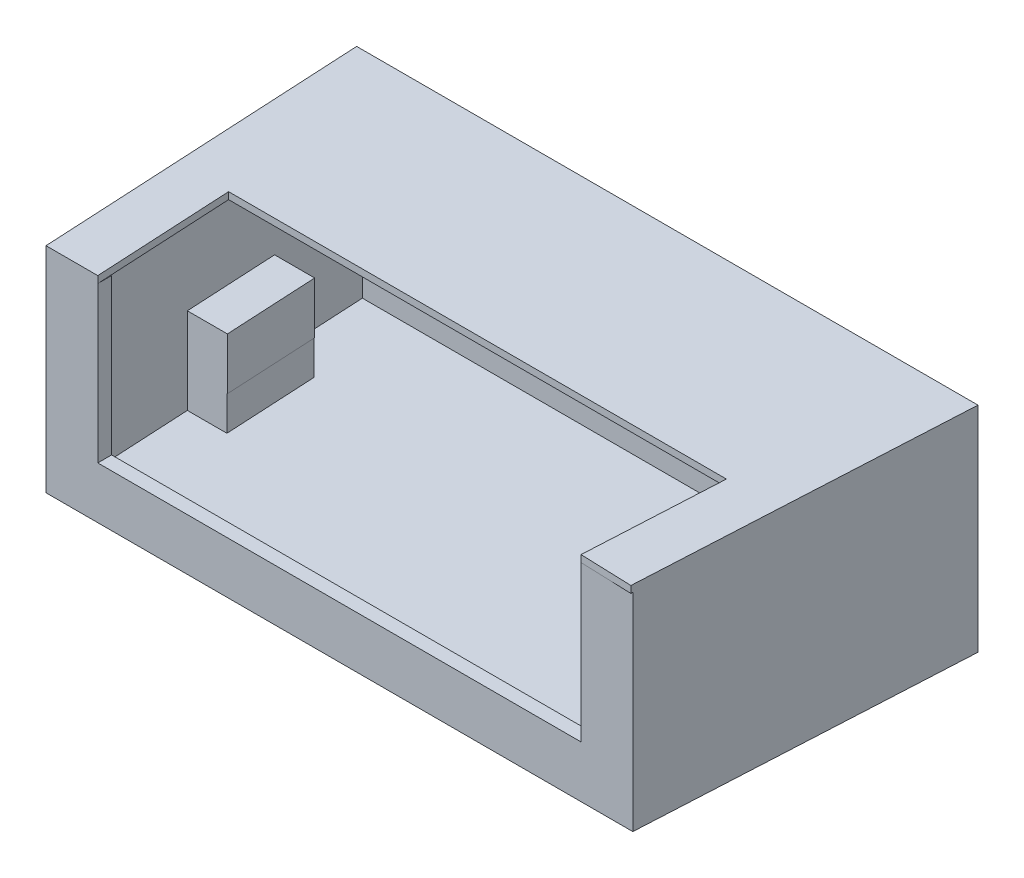
ISO-10303-21;
HEADER;
FILE_DESCRIPTION(('STEP AP214'),'2;1');
FILE_NAME('part.step','',(''),(''),'','','');
FILE_SCHEMA(('AUTOMOTIVE_DESIGN { 1 0 10303 214 1 1 1 1 }'));
ENDSEC;
DATA;
#1=APPLICATION_CONTEXT('core data for automotive mechanical design processes');
#2=APPLICATION_PROTOCOL_DEFINITION('international standard','automotive_design',2000,#1);
#3=PRODUCT_CONTEXT('',#1,'mechanical');
#4=PRODUCT('Part','Part','',(#3));
#5=PRODUCT_RELATED_PRODUCT_CATEGORY('part','',(#4));
#6=PRODUCT_DEFINITION_FORMATION('','',#4);
#7=PRODUCT_DEFINITION_CONTEXT('part definition',#1,'design');
#8=PRODUCT_DEFINITION('design','',#6,#7);
#9=PRODUCT_DEFINITION_SHAPE('','',#8);
#10=(LENGTH_UNIT() NAMED_UNIT(*) SI_UNIT(.MILLI.,.METRE.));
#11=(NAMED_UNIT(*) PLANE_ANGLE_UNIT() SI_UNIT($,.RADIAN.));
#12=(NAMED_UNIT(*) SI_UNIT($,.STERADIAN.) SOLID_ANGLE_UNIT());
#13=UNCERTAINTY_MEASURE_WITH_UNIT(LENGTH_MEASURE(1.E-05),#10,'distance_accuracy_value','');
#14=(GEOMETRIC_REPRESENTATION_CONTEXT(3) GLOBAL_UNCERTAINTY_ASSIGNED_CONTEXT((#13)) GLOBAL_UNIT_ASSIGNED_CONTEXT((#10,
#11,#12)) REPRESENTATION_CONTEXT('',''));
#15=CARTESIAN_POINT('',(0.,0.,0.));
#16=DIRECTION('',(0.,0.,1.));
#17=DIRECTION('',(1.,0.,0.));
#18=AXIS2_PLACEMENT_3D('',#15,#16,#17);
#19=CARTESIAN_POINT('',(0.,600.,0.));
#20=DIRECTION('',(0.,1.,0.));
#21=DIRECTION('',(0.,0.,1.));
#22=AXIS2_PLACEMENT_3D('',#19,#20,#21);
#23=PLANE('',#22);
#24=DIRECTION('',(-0.0525588331227629,0.,0.99861782933251));
#25=VECTOR('',#24,1.);
#26=CARTESIAN_POINT('',(721.056000817267,600.,-400.064015528074));
#27=LINE('',#26,#25);
#28=CARTESIAN_POINT('',(702.105263157895,600.,-40.0000000000002));
#29=VERTEX_POINT('',#28);
#30=CARTESIAN_POINT('',(700.,600.,0.));
#31=VERTEX_POINT('',#30);
#32=EDGE_CURVE('E11',#29,#31,#27,.T.);
#33=ORIENTED_EDGE('',*,*,#32,.F.);
#34=DIRECTION('',(1.,0.,0.));
#35=VECTOR('',#34,1.);
#36=CARTESIAN_POINT('',(785.,600.,-40.0000000000002));
#37=LINE('',#36,#35);
#38=CARTESIAN_POINT('',(700.,600.,-40.));
#39=VERTEX_POINT('',#38);
#40=EDGE_CURVE('E418',#39,#29,#37,.T.);
#41=ORIENTED_EDGE('',*,*,#40,.F.);
#42=DIRECTION('',(0.,0.,1.));
#43=VECTOR('',#42,1.);
#44=CARTESIAN_POINT('',(700.,600.,0.));
#45=LINE('',#44,#43);
#46=EDGE_CURVE('E399',#39,#31,#45,.T.);
#47=ORIENTED_EDGE('',*,*,#46,.T.);
#48=EDGE_LOOP('',(#33,#41,#47));
#49=FACE_BOUND('',#48,.T.);
#50=ADVANCED_FACE('F39',(#49),#23,.T.);
#51=CARTESIAN_POINT('',(0.,150.,0.));
#52=DIRECTION('',(0.,-1.,0.));
#53=DIRECTION('',(0.,0.,-1.));
#54=AXIS2_PLACEMENT_3D('',#51,#52,#53);
#55=PLANE('',#54);
#56=DIRECTION('',(0.0525588331227641,0.,-0.99861782933251));
#57=VECTOR('',#56,1.);
#58=CARTESIAN_POINT('',(709.135748768587,150.,-628.151045218347));
#59=LINE('',#58,#57);
#60=CARTESIAN_POINT('',(695.096165278991,150.,-361.398958916023));
#61=VERTEX_POINT('',#60);
#62=CARTESIAN_POINT('',(709.135748768587,150.,-628.151045218346));
#63=VERTEX_POINT('',#62);
#64=EDGE_CURVE('E365',#61,#63,#59,.T.);
#65=ORIENTED_EDGE('',*,*,#64,.T.);
#66=DIRECTION('',(1.,0.,0.));
#67=VECTOR('',#66,1.);
#68=CARTESIAN_POINT('',(708.81483793089,150.,-628.151045218346));
#69=LINE('',#68,#67);
#70=CARTESIAN_POINT('',(708.81483793089,150.,-628.151045218346));
#71=VERTEX_POINT('',#70);
#72=EDGE_CURVE('E301',#71,#63,#69,.T.);
#73=ORIENTED_EDGE('',*,*,#72,.F.);
#74=DIRECTION('',(0.0532842530242441,0.,-0.998579385116501));
#75=VECTOR('',#74,1.);
#76=CARTESIAN_POINT('',(694.580931370102,150.,-361.398958916023));
#77=LINE('',#76,#75);
#78=CARTESIAN_POINT('',(694.580931370102,150.,-361.398958916023));
#79=VERTEX_POINT('',#78);
#80=EDGE_CURVE('E337',#79,#71,#77,.T.);
#81=ORIENTED_EDGE('',*,*,#80,.F.);
#82=DIRECTION('',(1.,0.,0.));
#83=VECTOR('',#82,1.);
#84=CARTESIAN_POINT('',(0.,150.,-361.398958916023));
#85=LINE('',#84,#83);
#86=EDGE_CURVE('E43',#79,#61,#85,.T.);
#87=ORIENTED_EDGE('',*,*,#86,.T.);
#88=EDGE_LOOP('',(#65,#73,#81,#87));
#89=FACE_BOUND('',#88,.T.);
#90=ADVANCED_FACE('F462',(#89),#55,.F.);
#91=CARTESIAN_POINT('',(850.,600.,0.));
#92=DIRECTION('',(0.,0.,-1.));
#93=DIRECTION('',(-1.,0.,0.));
#94=AXIS2_PLACEMENT_3D('',#91,#92,#93);
#95=PLANE('',#94);
#96=DIRECTION('',(0.,-1.,0.));
#97=VECTOR('',#96,1.);
#98=CARTESIAN_POINT('',(-700.,610.,0.));
#99=LINE('',#98,#97);
#100=CARTESIAN_POINT('',(-700.,600.,0.));
#101=VERTEX_POINT('',#100);
#102=CARTESIAN_POINT('',(-700.,150.,0.));
#103=VERTEX_POINT('',#102);
#104=EDGE_CURVE('E384',#101,#103,#99,.T.);
#105=ORIENTED_EDGE('',*,*,#104,.F.);
#106=DIRECTION('',(0.,-1.,0.));
#107=VECTOR('',#106,1.);
#108=CARTESIAN_POINT('',(-700.,620.,0.));
#109=LINE('',#108,#107);
#110=CARTESIAN_POINT('',(-700.,620.,0.));
#111=VERTEX_POINT('',#110);
#112=EDGE_CURVE('E293',#111,#101,#109,.T.);
#113=ORIENTED_EDGE('',*,*,#112,.F.);
#114=DIRECTION('',(1.,0.,0.));
#115=VECTOR('',#114,1.);
#116=CARTESIAN_POINT('',(-850.,620.,0.));
#117=LINE('',#116,#115);
#118=CARTESIAN_POINT('',(-850.,620.,0.));
#119=VERTEX_POINT('',#118);
#120=EDGE_CURVE('E251',#119,#111,#117,.T.);
#121=ORIENTED_EDGE('',*,*,#120,.F.);
#122=DIRECTION('',(0.,-1.,0.));
#123=VECTOR('',#122,1.);
#124=CARTESIAN_POINT('',(-850.,600.,0.));
#125=LINE('',#124,#123);
#126=CARTESIAN_POINT('',(-850.,0.,0.));
#127=VERTEX_POINT('',#126);
#128=EDGE_CURVE('E243',#119,#127,#125,.T.);
#129=ORIENTED_EDGE('',*,*,#128,.T.);
#130=DIRECTION('',(1.,0.,0.));
#131=VECTOR('',#130,1.);
#132=CARTESIAN_POINT('',(850.,0.,0.));
#133=LINE('',#132,#131);
#134=CARTESIAN_POINT('',(850.,0.,0.));
#135=VERTEX_POINT('',#134);
#136=EDGE_CURVE('E424',#127,#135,#133,.T.);
#137=ORIENTED_EDGE('',*,*,#136,.T.);
#138=DIRECTION('',(0.,-1.,0.));
#139=VECTOR('',#138,1.);
#140=CARTESIAN_POINT('',(850.,600.,0.));
#141=LINE('',#140,#139);
#142=CARTESIAN_POINT('',(850.,600.,0.));
#143=VERTEX_POINT('',#142);
#144=EDGE_CURVE('E444',#143,#135,#141,.T.);
#145=ORIENTED_EDGE('',*,*,#144,.F.);
#146=DIRECTION('',(1.,0.,0.));
#147=VECTOR('',#146,1.);
#148=CARTESIAN_POINT('',(850.,600.,0.));
#149=LINE('',#148,#147);
#150=EDGE_CURVE('E432',#31,#143,#149,.T.);
#151=ORIENTED_EDGE('',*,*,#150,.F.);
#152=DIRECTION('',(0.,-1.,0.));
#153=VECTOR('',#152,1.);
#154=CARTESIAN_POINT('',(700.,610.,0.));
#155=LINE('',#154,#153);
#156=CARTESIAN_POINT('',(700.,150.,0.));
#157=VERTEX_POINT('',#156);
#158=EDGE_CURVE('E381',#31,#157,#155,.T.);
#159=ORIENTED_EDGE('',*,*,#158,.T.);
#160=DIRECTION('',(1.,0.,0.));
#161=VECTOR('',#160,1.);
#162=CARTESIAN_POINT('',(700.,150.,0.));
#163=LINE('',#162,#161);
#164=EDGE_CURVE('E359',#103,#157,#163,.T.);
#165=ORIENTED_EDGE('',*,*,#164,.F.);
#166=EDGE_LOOP('',(#105,#113,#121,#129,#137,#145,#151,#159,#165));
#167=FACE_BOUND('',#166,.T.);
#168=ADVANCED_FACE('F41',(#167),#95,.F.);
#169=DIRECTION('',(-0.052558833122764,0.,-0.99861782933251));
#170=VECTOR('',#169,1.);
#171=CARTESIAN_POINT('',(-700.,600.,0.));
#172=LINE('',#171,#170);
#173=CARTESIAN_POINT('',(-702.105263157895,600.,-40.));
#174=VERTEX_POINT('',#173);
#175=EDGE_CURVE('E274',#101,#174,#172,.T.);
#176=ORIENTED_EDGE('',*,*,#175,.F.);
#177=DIRECTION('',(0.,0.,-1.));
#178=VECTOR('',#177,1.);
#179=CARTESIAN_POINT('',(-700.,600.,0.));
#180=LINE('',#179,#178);
#181=CARTESIAN_POINT('',(-700.,600.,-40.));
#182=VERTEX_POINT('',#181);
#183=EDGE_CURVE('E401',#101,#182,#180,.T.);
#184=ORIENTED_EDGE('',*,*,#183,.T.);
#185=EDGE_CURVE('E417',#174,#182,#37,.T.);
#186=ORIENTED_EDGE('',*,*,#185,.F.);
#187=EDGE_LOOP('',(#176,#184,#186));
#188=FACE_BOUND('',#187,.T.);
#189=ADVANCED_FACE('F527',(#188),#23,.T.);
#190=CARTESIAN_POINT('',(785.,300.,-40.0000000000002));
#191=DIRECTION('',(0.,0.,1.));
#192=DIRECTION('',(1.,0.,0.));
#193=AXIS2_PLACEMENT_3D('',#190,#191,#192);
#194=PLANE('',#193);
#195=DIRECTION('',(0.,-1.,0.));
#196=VECTOR('',#195,1.);
#197=CARTESIAN_POINT('',(700.,610.,-40.));
#198=LINE('',#197,#196);
#199=CARTESIAN_POINT('',(700.,150.,-40.));
#200=VERTEX_POINT('',#199);
#201=EDGE_CURVE('E378',#39,#200,#198,.T.);
#202=ORIENTED_EDGE('',*,*,#201,.F.);
#203=ORIENTED_EDGE('',*,*,#40,.T.);
#204=CARTESIAN_POINT('',(785.,600.,-40.0000000000002));
#205=VERTEX_POINT('',#204);
#206=EDGE_CURVE('E413',#29,#205,#37,.T.);
#207=ORIENTED_EDGE('',*,*,#206,.T.);
#208=DIRECTION('',(0.,1.,0.));
#209=VECTOR('',#208,1.);
#210=CARTESIAN_POINT('',(785.,300.,-40.0000000000002));
#211=LINE('',#210,#209);
#212=CARTESIAN_POINT('',(785.,50.,-40.));
#213=VERTEX_POINT('',#212);
#214=EDGE_CURVE('E428',#213,#205,#211,.T.);
#215=ORIENTED_EDGE('',*,*,#214,.F.);
#216=DIRECTION('',(1.,0.,0.));
#217=VECTOR('',#216,1.);
#218=CARTESIAN_POINT('',(-785.,50.,-40.));
#219=LINE('',#218,#217);
#220=CARTESIAN_POINT('',(-785.,50.,-40.));
#221=VERTEX_POINT('',#220);
#222=EDGE_CURVE('E316',#221,#213,#219,.T.);
#223=ORIENTED_EDGE('',*,*,#222,.F.);
#224=DIRECTION('',(0.,1.,0.));
#225=VECTOR('',#224,1.);
#226=CARTESIAN_POINT('',(-785.,300.,-40.));
#227=LINE('',#226,#225);
#228=CARTESIAN_POINT('',(-785.,600.,-40.));
#229=VERTEX_POINT('',#228);
#230=EDGE_CURVE('E411',#221,#229,#227,.T.);
#231=ORIENTED_EDGE('',*,*,#230,.T.);
#232=EDGE_CURVE('E414',#229,#174,#37,.T.);
#233=ORIENTED_EDGE('',*,*,#232,.T.);
#234=ORIENTED_EDGE('',*,*,#185,.T.);
#235=DIRECTION('',(0.,-1.,0.));
#236=VECTOR('',#235,1.);
#237=CARTESIAN_POINT('',(-700.,610.,-40.));
#238=LINE('',#237,#236);
#239=CARTESIAN_POINT('',(-700.,150.,-40.));
#240=VERTEX_POINT('',#239);
#241=EDGE_CURVE('E386',#182,#240,#238,.T.);
#242=ORIENTED_EDGE('',*,*,#241,.T.);
#243=DIRECTION('',(-1.,0.,0.));
#244=VECTOR('',#243,1.);
#245=CARTESIAN_POINT('',(0.,150.,-40.));
#246=LINE('',#245,#244);
#247=EDGE_CURVE('E458',#200,#240,#246,.T.);
#248=ORIENTED_EDGE('',*,*,#247,.F.);
#249=EDGE_LOOP('',(#202,#203,#207,#215,#223,#231,#233,#234,#242,#248));
#250=FACE_BOUND('',#249,.T.);
#251=ADVANCED_FACE('F523',(#250),#194,.F.);
#252=CARTESIAN_POINT('',(0.,300.,0.));
#253=DIRECTION('',(0.,-1.,0.));
#254=DIRECTION('',(0.,0.,-1.));
#255=AXIS2_PLACEMENT_3D('',#252,#253,#254);
#256=PLANE('',#255);
#257=DIRECTION('',(1.,0.,0.));
#258=VECTOR('',#257,1.);
#259=CARTESIAN_POINT('',(0.,300.,-628.151045218346));
#260=LINE('',#259,#258);
#261=CARTESIAN_POINT('',(-815.955318169387,300.,-628.151045218346));
#262=VERTEX_POINT('',#261);
#263=CARTESIAN_POINT('',(-699.853867240202,300.,-628.151045218346));
#264=VERTEX_POINT('',#263);
#265=EDGE_CURVE('E457',#262,#264,#260,.T.);
#266=ORIENTED_EDGE('',*,*,#265,.F.);
#267=DIRECTION('',(0.0525588331227639,0.,0.99861782933251));
#268=VECTOR('',#267,1.);
#269=CARTESIAN_POINT('',(-785.,300.,-40.));
#270=LINE('',#269,#268);
#271=CARTESIAN_POINT('',(-801.915734679791,300.,-361.398958916023));
#272=VERTEX_POINT('',#271);
#273=EDGE_CURVE('E404',#262,#272,#270,.T.);
#274=ORIENTED_EDGE('',*,*,#273,.T.);
#275=DIRECTION('',(-1.,0.,0.));
#276=VECTOR('',#275,1.);
#277=CARTESIAN_POINT('',(0.,300.,-361.398958916023));
#278=LINE('',#277,#276);
#279=CARTESIAN_POINT('',(-685.814283750606,300.,-361.398958916023));
#280=VERTEX_POINT('',#279);
#281=EDGE_CURVE('E453',#280,#272,#278,.T.);
#282=ORIENTED_EDGE('',*,*,#281,.F.);
#283=DIRECTION('',(0.0525588331227637,0.,0.99861782933251));
#284=VECTOR('',#283,1.);
#285=CARTESIAN_POINT('',(-664.951315509846,300.,34.997437658413));
#286=LINE('',#285,#284);
#287=EDGE_CURVE('E455',#264,#280,#286,.T.);
#288=ORIENTED_EDGE('',*,*,#287,.F.);
#289=EDGE_LOOP('',(#266,#274,#282,#288));
#290=FACE_BOUND('',#289,.T.);
#291=ADVANCED_FACE('F526',(#290),#256,.F.);
#292=DIRECTION('',(-1.,0.,0.));
#293=VECTOR('',#292,1.);
#294=CARTESIAN_POINT('',(0.,300.,-361.398958916023));
#295=LINE('',#294,#293);
#296=CARTESIAN_POINT('',(801.915734679791,300.,-361.398958916023));
#297=VERTEX_POINT('',#296);
#298=CARTESIAN_POINT('',(695.096165278991,300.,-361.398958916023));
#299=VERTEX_POINT('',#298);
#300=EDGE_CURVE('E451',#297,#299,#295,.T.);
#301=ORIENTED_EDGE('',*,*,#300,.F.);
#302=DIRECTION('',(0.0525588331227637,0.,-0.99861782933251));
#303=VECTOR('',#302,1.);
#304=CARTESIAN_POINT('',(830.084404495928,300.,-896.603685422627));
#305=LINE('',#304,#303);
#306=CARTESIAN_POINT('',(815.955318169387,300.,-628.151045218347));
#307=VERTEX_POINT('',#306);
#308=EDGE_CURVE('E407',#297,#307,#305,.T.);
#309=ORIENTED_EDGE('',*,*,#308,.T.);
#310=DIRECTION('',(1.,0.,0.));
#311=VECTOR('',#310,1.);
#312=CARTESIAN_POINT('',(0.,300.,-628.151045218347));
#313=LINE('',#312,#311);
#314=CARTESIAN_POINT('',(709.135748768587,300.,-628.151045218347));
#315=VERTEX_POINT('',#314);
#316=EDGE_CURVE('E447',#315,#307,#313,.T.);
#317=ORIENTED_EDGE('',*,*,#316,.F.);
#318=DIRECTION('',(0.0525588331227641,0.,-0.99861782933251));
#319=VECTOR('',#318,1.);
#320=CARTESIAN_POINT('',(674.207556481523,300.,35.4846082358699));
#321=LINE('',#320,#319);
#322=EDGE_CURVE('E449',#299,#315,#321,.T.);
#323=ORIENTED_EDGE('',*,*,#322,.F.);
#324=EDGE_LOOP('',(#301,#309,#317,#323));
#325=FACE_BOUND('',#324,.T.);
#326=ADVANCED_FACE('F478',(#325),#256,.F.);
#327=CARTESIAN_POINT('',(900.,600.,-950.));
#328=DIRECTION('',(-0.99861782933251,0.,-0.0525588331227637));
#329=DIRECTION('',(-0.0525588331227637,0.,0.99861782933251));
#330=AXIS2_PLACEMENT_3D('',#327,#328,#329);
#331=PLANE('',#330);
#332=DIRECTION('',(0.0525588331227637,0.,-0.99861782933251));
#333=VECTOR('',#332,1.);
#334=CARTESIAN_POINT('',(900.,0.,-950.));
#335=LINE('',#334,#333);
#336=CARTESIAN_POINT('',(900.,0.,-950.));
#337=VERTEX_POINT('',#336);
#338=EDGE_CURVE('E438',#135,#337,#335,.T.);
#339=ORIENTED_EDGE('',*,*,#338,.T.);
#340=DIRECTION('',(0.,-1.,0.));
#341=VECTOR('',#340,1.);
#342=CARTESIAN_POINT('',(900.,600.,-950.));
#343=LINE('',#342,#341);
#344=CARTESIAN_POINT('',(900.,620.,-950.));
#345=VERTEX_POINT('',#344);
#346=EDGE_CURVE('E242',#345,#337,#343,.T.);
#347=ORIENTED_EDGE('',*,*,#346,.F.);
#348=DIRECTION('',(0.0525588331227637,0.,-0.99861782933251));
#349=VECTOR('',#348,1.);
#350=CARTESIAN_POINT('',(849.722904554035,620.,5.26481347332682));
#351=LINE('',#350,#349);
#352=CARTESIAN_POINT('',(849.722904554035,620.,5.26481347332682));
#353=VERTEX_POINT('',#352);
#354=EDGE_CURVE('E256',#353,#345,#351,.T.);
#355=ORIENTED_EDGE('',*,*,#354,.F.);
#356=DIRECTION('',(0.,-1.,0.));
#357=VECTOR('',#356,1.);
#358=CARTESIAN_POINT('',(849.722904554035,620.,5.26481347332682));
#359=LINE('',#358,#357);
#360=CARTESIAN_POINT('',(849.722904554035,600.,5.26481347332682));
#361=VERTEX_POINT('',#360);
#362=EDGE_CURVE('E273',#353,#361,#359,.T.);
#363=ORIENTED_EDGE('',*,*,#362,.T.);
#364=DIRECTION('',(0.0525588331227637,0.,-0.99861782933251));
#365=VECTOR('',#364,1.);
#366=CARTESIAN_POINT('',(849.722904554035,600.,5.26481347332682));
#367=LINE('',#366,#365);
#368=EDGE_CURVE('E257',#361,#143,#367,.T.);
#369=ORIENTED_EDGE('',*,*,#368,.T.);
#370=ORIENTED_EDGE('',*,*,#144,.T.);
#371=EDGE_LOOP('',(#339,#347,#355,#363,#369,#370));
#372=FACE_BOUND('',#371,.T.);
#373=ADVANCED_FACE('F553',(#372),#331,.F.);
#374=CARTESIAN_POINT('',(-900.,600.,-950.));
#375=DIRECTION('',(0.,0.,1.));
#376=DIRECTION('',(1.,0.,0.));
#377=AXIS2_PLACEMENT_3D('',#374,#375,#376);
#378=PLANE('',#377);
#379=DIRECTION('',(-1.,0.,0.));
#380=VECTOR('',#379,1.);
#381=CARTESIAN_POINT('',(-900.,0.,-950.));
#382=LINE('',#381,#380);
#383=CARTESIAN_POINT('',(-900.,0.,-950.));
#384=VERTEX_POINT('',#383);
#385=EDGE_CURVE('E239',#337,#384,#382,.T.);
#386=ORIENTED_EDGE('',*,*,#385,.T.);
#387=DIRECTION('',(0.,-1.,0.));
#388=VECTOR('',#387,1.);
#389=CARTESIAN_POINT('',(-900.,600.,-950.));
#390=LINE('',#389,#388);
#391=CARTESIAN_POINT('',(-900.,620.,-950.));
#392=VERTEX_POINT('',#391);
#393=EDGE_CURVE('E232',#392,#384,#390,.T.);
#394=ORIENTED_EDGE('',*,*,#393,.F.);
#395=DIRECTION('',(-1.,0.,0.));
#396=VECTOR('',#395,1.);
#397=CARTESIAN_POINT('',(900.,620.,-950.));
#398=LINE('',#397,#396);
#399=EDGE_CURVE('E237',#345,#392,#398,.T.);
#400=ORIENTED_EDGE('',*,*,#399,.F.);
#401=ORIENTED_EDGE('',*,*,#346,.T.);
#402=EDGE_LOOP('',(#386,#394,#400,#401));
#403=FACE_BOUND('',#402,.T.);
#404=ADVANCED_FACE('F234',(#403),#378,.F.);
#405=CARTESIAN_POINT('',(-900.,600.,-950.));
#406=DIRECTION('',(0.99861782933251,0.,-0.0525588331227637));
#407=DIRECTION('',(-0.0525588331227637,0.,-0.99861782933251));
#408=AXIS2_PLACEMENT_3D('',#405,#406,#407);
#409=PLANE('',#408);
#410=DIRECTION('',(0.0525588331227637,0.,0.99861782933251));
#411=VECTOR('',#410,1.);
#412=CARTESIAN_POINT('',(-900.,0.,-950.));
#413=LINE('',#412,#411);
#414=EDGE_CURVE('E435',#384,#127,#413,.T.);
#415=ORIENTED_EDGE('',*,*,#414,.T.);
#416=ORIENTED_EDGE('',*,*,#128,.F.);
#417=DIRECTION('',(0.0525588331227636,0.,0.99861782933251));
#418=VECTOR('',#417,1.);
#419=CARTESIAN_POINT('',(-900.,620.,-950.));
#420=LINE('',#419,#418);
#421=EDGE_CURVE('E246',#392,#119,#420,.T.);
#422=ORIENTED_EDGE('',*,*,#421,.F.);
#423=ORIENTED_EDGE('',*,*,#393,.T.);
#424=EDGE_LOOP('',(#415,#416,#422,#423));
#425=FACE_BOUND('',#424,.T.);
#426=ADVANCED_FACE('F247',(#425),#409,.F.);
#427=CARTESIAN_POINT('',(0.,0.,0.));
#428=DIRECTION('',(0.,1.,0.));
#429=DIRECTION('',(0.,0.,1.));
#430=AXIS2_PLACEMENT_3D('',#427,#428,#429);
#431=PLANE('',#430);
#432=ORIENTED_EDGE('',*,*,#136,.F.);
#433=ORIENTED_EDGE('',*,*,#414,.F.);
#434=ORIENTED_EDGE('',*,*,#385,.F.);
#435=ORIENTED_EDGE('',*,*,#338,.F.);
#436=EDGE_LOOP('',(#432,#433,#434,#435));
#437=FACE_BOUND('',#436,.T.);
#438=ADVANCED_FACE('F546',(#437),#431,.F.);
#439=CARTESIAN_POINT('',(-785.,300.,-40.));
#440=DIRECTION('',(-0.99861782933251,0.,0.0525588331227639));
#441=DIRECTION('',(0.0525588331227639,0.,0.99861782933251));
#442=AXIS2_PLACEMENT_3D('',#439,#440,#441);
#443=PLANE('',#442);
#444=ORIENTED_EDGE('',*,*,#230,.F.);
#445=DIRECTION('',(0.052558833122764,0.,0.99861782933251));
#446=VECTOR('',#445,1.);
#447=CARTESIAN_POINT('',(-801.915734679791,50.,-361.398958916023));
#448=LINE('',#447,#446);
#449=CARTESIAN_POINT('',(-801.915734679791,50.,-361.398958916023));
#450=VERTEX_POINT('',#449);
#451=EDGE_CURVE('E313',#450,#221,#448,.T.);
#452=ORIENTED_EDGE('',*,*,#451,.F.);
#453=DIRECTION('',(0.,-1.,0.));
#454=VECTOR('',#453,1.);
#455=CARTESIAN_POINT('',(-801.915734679791,610.,-361.398958916023));
#456=LINE('',#455,#454);
#457=EDGE_CURVE('E389',#272,#450,#456,.T.);
#458=ORIENTED_EDGE('',*,*,#457,.F.);
#459=ORIENTED_EDGE('',*,*,#273,.F.);
#460=DIRECTION('',(0.,-1.,0.));
#461=VECTOR('',#460,1.);
#462=CARTESIAN_POINT('',(-815.955318169387,610.,-628.151045218346));
#463=LINE('',#462,#461);
#464=CARTESIAN_POINT('',(-815.955318169387,50.,-628.151045218346));
#465=VERTEX_POINT('',#464);
#466=EDGE_CURVE('E397',#262,#465,#463,.T.);
#467=ORIENTED_EDGE('',*,*,#466,.T.);
#468=DIRECTION('',(0.0525588331227636,0.,0.99861782933251));
#469=VECTOR('',#468,1.);
#470=CARTESIAN_POINT('',(-830.084404495928,50.,-896.603685422627));
#471=LINE('',#470,#469);
#472=CARTESIAN_POINT('',(-830.084404495928,50.,-896.603685422627));
#473=VERTEX_POINT('',#472);
#474=EDGE_CURVE('E300',#473,#465,#471,.T.);
#475=ORIENTED_EDGE('',*,*,#474,.F.);
#476=DIRECTION('',(0.,1.,0.));
#477=VECTOR('',#476,1.);
#478=CARTESIAN_POINT('',(-830.084404495928,300.,-896.603685422627));
#479=LINE('',#478,#477);
#480=CARTESIAN_POINT('',(-830.084404495928,600.,-896.603685422627));
#481=VERTEX_POINT('',#480);
#482=EDGE_CURVE('E422',#473,#481,#479,.T.);
#483=ORIENTED_EDGE('',*,*,#482,.T.);
#484=DIRECTION('',(0.0525588331227639,0.,0.99861782933251));
#485=VECTOR('',#484,1.);
#486=CARTESIAN_POINT('',(-785.,600.,-40.));
#487=LINE('',#486,#485);
#488=EDGE_CURVE('E62',#481,#229,#487,.T.);
#489=ORIENTED_EDGE('',*,*,#488,.T.);
#490=EDGE_LOOP('',(#444,#452,#458,#459,#467,#475,#483,#489));
#491=FACE_BOUND('',#490,.T.);
#492=ADVANCED_FACE('F505',(#491),#443,.F.);
#493=CARTESIAN_POINT('',(-830.084404495928,300.,-896.603685422627));
#494=DIRECTION('',(0.,0.,-1.));
#495=DIRECTION('',(-1.,0.,0.));
#496=AXIS2_PLACEMENT_3D('',#493,#494,#495);
#497=PLANE('',#496);
#498=DIRECTION('',(-1.,0.,0.));
#499=VECTOR('',#498,1.);
#500=CARTESIAN_POINT('',(-830.084404495928,600.,-896.603685422627));
#501=LINE('',#500,#499);
#502=CARTESIAN_POINT('',(830.084404495928,600.,-896.603685422627));
#503=VERTEX_POINT('',#502);
#504=EDGE_CURVE('E408',#503,#481,#501,.T.);
#505=ORIENTED_EDGE('',*,*,#504,.T.);
#506=ORIENTED_EDGE('',*,*,#482,.F.);
#507=DIRECTION('',(-1.,0.,0.));
#508=VECTOR('',#507,1.);
#509=CARTESIAN_POINT('',(830.084404495928,50.,-896.603685422627));
#510=LINE('',#509,#508);
#511=CARTESIAN_POINT('',(830.084404495928,50.,-896.603685422627));
#512=VERTEX_POINT('',#511);
#513=EDGE_CURVE('E297',#512,#473,#510,.T.);
#514=ORIENTED_EDGE('',*,*,#513,.F.);
#515=DIRECTION('',(0.,1.,0.));
#516=VECTOR('',#515,1.);
#517=CARTESIAN_POINT('',(830.084404495928,300.,-896.603685422627));
#518=LINE('',#517,#516);
#519=EDGE_CURVE('E425',#512,#503,#518,.T.);
#520=ORIENTED_EDGE('',*,*,#519,.T.);
#521=EDGE_LOOP('',(#505,#506,#514,#520));
#522=FACE_BOUND('',#521,.T.);
#523=ADVANCED_FACE('F501',(#522),#497,.F.);
#524=CARTESIAN_POINT('',(830.084404495928,300.,-896.603685422627));
#525=DIRECTION('',(0.99861782933251,0.,0.0525588331227637));
#526=DIRECTION('',(0.0525588331227637,0.,-0.99861782933251));
#527=AXIS2_PLACEMENT_3D('',#524,#525,#526);
#528=PLANE('',#527);
#529=ORIENTED_EDGE('',*,*,#519,.F.);
#530=DIRECTION('',(0.0525588331227637,0.,-0.99861782933251));
#531=VECTOR('',#530,1.);
#532=CARTESIAN_POINT('',(815.955318169387,50.,-628.151045218347));
#533=LINE('',#532,#531);
#534=CARTESIAN_POINT('',(815.955318169387,50.,-628.151045218347));
#535=VERTEX_POINT('',#534);
#536=EDGE_CURVE('E331',#535,#512,#533,.T.);
#537=ORIENTED_EDGE('',*,*,#536,.F.);
#538=DIRECTION('',(0.,-1.,0.));
#539=VECTOR('',#538,1.);
#540=CARTESIAN_POINT('',(815.955318169387,610.,-628.151045218347));
#541=LINE('',#540,#539);
#542=EDGE_CURVE('E368',#307,#535,#541,.T.);
#543=ORIENTED_EDGE('',*,*,#542,.F.);
#544=ORIENTED_EDGE('',*,*,#308,.F.);
#545=DIRECTION('',(0.,-1.,0.));
#546=VECTOR('',#545,1.);
#547=CARTESIAN_POINT('',(801.915734679791,610.,-361.398958916023));
#548=LINE('',#547,#546);
#549=CARTESIAN_POINT('',(801.915734679791,50.,-361.398958916023));
#550=VERTEX_POINT('',#549);
#551=EDGE_CURVE('E376',#297,#550,#548,.T.);
#552=ORIENTED_EDGE('',*,*,#551,.T.);
#553=DIRECTION('',(0.0525588331227637,0.,-0.99861782933251));
#554=VECTOR('',#553,1.);
#555=CARTESIAN_POINT('',(785.,50.,-40.));
#556=LINE('',#555,#554);
#557=EDGE_CURVE('E319',#213,#550,#556,.T.);
#558=ORIENTED_EDGE('',*,*,#557,.F.);
#559=ORIENTED_EDGE('',*,*,#214,.T.);
#560=DIRECTION('',(0.0525588331227637,0.,-0.99861782933251));
#561=VECTOR('',#560,1.);
#562=CARTESIAN_POINT('',(830.084404495928,600.,-896.603685422627));
#563=LINE('',#562,#561);
#564=EDGE_CURVE('E416',#205,#503,#563,.T.);
#565=ORIENTED_EDGE('',*,*,#564,.T.);
#566=EDGE_LOOP('',(#529,#537,#543,#544,#552,#558,#559,#565));
#567=FACE_BOUND('',#566,.T.);
#568=ADVANCED_FACE('F481',(#567),#528,.F.);
#569=CARTESIAN_POINT('',(-699.853867240202,610.,-628.151045218346));
#570=DIRECTION('',(0.,0.,-1.));
#571=DIRECTION('',(-1.,0.,0.));
#572=AXIS2_PLACEMENT_3D('',#569,#570,#571);
#573=PLANE('',#572);
#574=ORIENTED_EDGE('',*,*,#265,.T.);
#575=DIRECTION('',(0.,-1.,0.));
#576=VECTOR('',#575,1.);
#577=CARTESIAN_POINT('',(-699.853867240202,610.,-628.151045218346));
#578=LINE('',#577,#576);
#579=CARTESIAN_POINT('',(-699.853867240202,150.,-628.151045218347));
#580=VERTEX_POINT('',#579);
#581=EDGE_CURVE('E394',#264,#580,#578,.T.);
#582=ORIENTED_EDGE('',*,*,#581,.T.);
#583=DIRECTION('',(1.,0.,0.));
#584=VECTOR('',#583,1.);
#585=CARTESIAN_POINT('',(-699.853867240202,150.,-628.151045218346));
#586=LINE('',#585,#584);
#587=CARTESIAN_POINT('',(-701.325281658441,150.,-628.151045218346));
#588=VERTEX_POINT('',#587);
#589=EDGE_CURVE('E343',#588,#580,#586,.T.);
#590=ORIENTED_EDGE('',*,*,#589,.F.);
#591=DIRECTION('',(0.,1.,0.));
#592=VECTOR('',#591,1.);
#593=CARTESIAN_POINT('',(-701.325281658441,50.,-628.151045218346));
#594=LINE('',#593,#592);
#595=CARTESIAN_POINT('',(-701.325281658441,50.,-628.151045218346));
#596=VERTEX_POINT('',#595);
#597=EDGE_CURVE('E334',#596,#588,#594,.T.);
#598=ORIENTED_EDGE('',*,*,#597,.F.);
#599=DIRECTION('',(1.,0.,0.));
#600=VECTOR('',#599,1.);
#601=CARTESIAN_POINT('',(-815.955318169387,50.,-628.151045218346));
#602=LINE('',#601,#600);
#603=EDGE_CURVE('E304',#465,#596,#602,.T.);
#604=ORIENTED_EDGE('',*,*,#603,.F.);
#605=ORIENTED_EDGE('',*,*,#466,.F.);
#606=EDGE_LOOP('',(#574,#582,#590,#598,#604,#605));
#607=FACE_BOUND('',#606,.T.);
#608=ADVANCED_FACE('F510',(#607),#573,.T.);
#609=CARTESIAN_POINT('',(-685.814283750606,610.,-361.398958916023));
#610=DIRECTION('',(0.99861782933251,0.,-0.0525588331227637));
#611=DIRECTION('',(-0.0525588331227637,0.,-0.99861782933251));
#612=AXIS2_PLACEMENT_3D('',#609,#610,#611);
#613=PLANE('',#612);
#614=ORIENTED_EDGE('',*,*,#287,.T.);
#615=DIRECTION('',(0.,-1.,0.));
#616=VECTOR('',#615,1.);
#617=CARTESIAN_POINT('',(-685.814283750606,610.,-361.398958916023));
#618=LINE('',#617,#616);
#619=CARTESIAN_POINT('',(-685.814283750606,150.,-361.398958916023));
#620=VERTEX_POINT('',#619);
#621=EDGE_CURVE('E391',#280,#620,#618,.T.);
#622=ORIENTED_EDGE('',*,*,#621,.T.);
#623=DIRECTION('',(0.0525588331227637,0.,0.99861782933251));
#624=VECTOR('',#623,1.);
#625=CARTESIAN_POINT('',(-685.814283750606,150.,-361.398958916023));
#626=LINE('',#625,#624);
#627=EDGE_CURVE('E352',#580,#620,#626,.T.);
#628=ORIENTED_EDGE('',*,*,#627,.F.);
#629=ORIENTED_EDGE('',*,*,#581,.F.);
#630=EDGE_LOOP('',(#614,#622,#628,#629));
#631=FACE_BOUND('',#630,.T.);
#632=ADVANCED_FACE('F607',(#631),#613,.T.);
#633=CARTESIAN_POINT('',(-801.915734679791,610.,-361.398958916023));
#634=DIRECTION('',(0.,0.,1.));
#635=DIRECTION('',(1.,0.,0.));
#636=AXIS2_PLACEMENT_3D('',#633,#634,#635);
#637=PLANE('',#636);
#638=ORIENTED_EDGE('',*,*,#281,.T.);
#639=ORIENTED_EDGE('',*,*,#457,.T.);
#640=DIRECTION('',(-1.,0.,0.));
#641=VECTOR('',#640,1.);
#642=CARTESIAN_POINT('',(-687.285698168845,50.,-361.398958916023));
#643=LINE('',#642,#641);
#644=CARTESIAN_POINT('',(-687.285698168845,50.,-361.398958916023));
#645=VERTEX_POINT('',#644);
#646=EDGE_CURVE('E310',#645,#450,#643,.T.);
#647=ORIENTED_EDGE('',*,*,#646,.F.);
#648=DIRECTION('',(0.,1.,0.));
#649=VECTOR('',#648,1.);
#650=CARTESIAN_POINT('',(-687.285698168845,50.,-361.398958916023));
#651=LINE('',#650,#649);
#652=CARTESIAN_POINT('',(-687.285698168845,150.,-361.398958916023));
#653=VERTEX_POINT('',#652);
#654=EDGE_CURVE('E347',#645,#653,#651,.T.);
#655=ORIENTED_EDGE('',*,*,#654,.T.);
#656=DIRECTION('',(-1.,0.,0.));
#657=VECTOR('',#656,1.);
#658=CARTESIAN_POINT('',(-801.915734679791,150.,-361.398958916023));
#659=LINE('',#658,#657);
#660=EDGE_CURVE('E354',#620,#653,#659,.T.);
#661=ORIENTED_EDGE('',*,*,#660,.F.);
#662=ORIENTED_EDGE('',*,*,#621,.F.);
#663=EDGE_LOOP('',(#638,#639,#647,#655,#661,#662));
#664=FACE_BOUND('',#663,.T.);
#665=ADVANCED_FACE('F519',(#664),#637,.T.);
#666=CARTESIAN_POINT('',(695.096165278991,610.,-361.398958916023));
#667=DIRECTION('',(0.,0.,1.));
#668=DIRECTION('',(1.,0.,0.));
#669=AXIS2_PLACEMENT_3D('',#666,#667,#668);
#670=PLANE('',#669);
#671=ORIENTED_EDGE('',*,*,#300,.T.);
#672=DIRECTION('',(0.,-1.,0.));
#673=VECTOR('',#672,1.);
#674=CARTESIAN_POINT('',(695.096165278991,610.,-361.398958916023));
#675=LINE('',#674,#673);
#676=EDGE_CURVE('E373',#299,#61,#675,.T.);
#677=ORIENTED_EDGE('',*,*,#676,.T.);
#678=ORIENTED_EDGE('',*,*,#86,.F.);
#679=DIRECTION('',(0.,1.,0.));
#680=VECTOR('',#679,1.);
#681=CARTESIAN_POINT('',(694.580931370102,50.,-361.398958916023));
#682=LINE('',#681,#680);
#683=CARTESIAN_POINT('',(694.580931370102,50.,-361.398958916023));
#684=VERTEX_POINT('',#683);
#685=EDGE_CURVE('E344',#684,#79,#682,.T.);
#686=ORIENTED_EDGE('',*,*,#685,.F.);
#687=DIRECTION('',(-1.,0.,0.));
#688=VECTOR('',#687,1.);
#689=CARTESIAN_POINT('',(801.915734679791,50.,-361.398958916023));
#690=LINE('',#689,#688);
#691=EDGE_CURVE('E322',#550,#684,#690,.T.);
#692=ORIENTED_EDGE('',*,*,#691,.F.);
#693=ORIENTED_EDGE('',*,*,#551,.F.);
#694=EDGE_LOOP('',(#671,#677,#678,#686,#692,#693));
#695=FACE_BOUND('',#694,.T.);
#696=ADVANCED_FACE('F467',(#695),#670,.T.);
#697=CARTESIAN_POINT('',(709.135748768587,610.,-628.151045218347));
#698=DIRECTION('',(-0.99861782933251,0.,-0.0525588331227641));
#699=DIRECTION('',(-0.0525588331227641,0.,0.99861782933251));
#700=AXIS2_PLACEMENT_3D('',#697,#698,#699);
#701=PLANE('',#700);
#702=ORIENTED_EDGE('',*,*,#322,.T.);
#703=DIRECTION('',(0.,-1.,0.));
#704=VECTOR('',#703,1.);
#705=CARTESIAN_POINT('',(709.135748768587,610.,-628.151045218347));
#706=LINE('',#705,#704);
#707=EDGE_CURVE('E370',#315,#63,#706,.T.);
#708=ORIENTED_EDGE('',*,*,#707,.T.);
#709=ORIENTED_EDGE('',*,*,#64,.F.);
#710=ORIENTED_EDGE('',*,*,#676,.F.);
#711=EDGE_LOOP('',(#702,#708,#709,#710));
#712=FACE_BOUND('',#711,.T.);
#713=ADVANCED_FACE('F471',(#712),#701,.T.);
#714=CARTESIAN_POINT('',(815.955318169387,610.,-628.151045218347));
#715=DIRECTION('',(0.,0.,-1.));
#716=DIRECTION('',(-1.,0.,0.));
#717=AXIS2_PLACEMENT_3D('',#714,#715,#716);
#718=PLANE('',#717);
#719=ORIENTED_EDGE('',*,*,#316,.T.);
#720=ORIENTED_EDGE('',*,*,#542,.T.);
#721=DIRECTION('',(1.,0.,0.));
#722=VECTOR('',#721,1.);
#723=CARTESIAN_POINT('',(708.81483793089,50.,-628.151045218346));
#724=LINE('',#723,#722);
#725=CARTESIAN_POINT('',(708.81483793089,50.,-628.151045218346));
#726=VERTEX_POINT('',#725);
#727=EDGE_CURVE('E328',#726,#535,#724,.T.);
#728=ORIENTED_EDGE('',*,*,#727,.F.);
#729=DIRECTION('',(0.,1.,0.));
#730=VECTOR('',#729,1.);
#731=CARTESIAN_POINT('',(708.81483793089,50.,-628.151045218346));
#732=LINE('',#731,#730);
#733=EDGE_CURVE('E341',#726,#71,#732,.T.);
#734=ORIENTED_EDGE('',*,*,#733,.T.);
#735=ORIENTED_EDGE('',*,*,#72,.T.);
#736=ORIENTED_EDGE('',*,*,#707,.F.);
#737=EDGE_LOOP('',(#719,#720,#728,#734,#735,#736));
#738=FACE_BOUND('',#737,.T.);
#739=ADVANCED_FACE('F475',(#738),#718,.T.);
#740=CARTESIAN_POINT('',(-700.,610.,0.));
#741=DIRECTION('',(1.,0.,0.));
#742=DIRECTION('',(0.,0.,-1.));
#743=AXIS2_PLACEMENT_3D('',#740,#741,#742);
#744=PLANE('',#743);
#745=ORIENTED_EDGE('',*,*,#104,.T.);
#746=DIRECTION('',(0.,0.,1.));
#747=VECTOR('',#746,1.);
#748=CARTESIAN_POINT('',(-700.,150.,0.));
#749=LINE('',#748,#747);
#750=EDGE_CURVE('E356',#240,#103,#749,.T.);
#751=ORIENTED_EDGE('',*,*,#750,.F.);
#752=ORIENTED_EDGE('',*,*,#241,.F.);
#753=ORIENTED_EDGE('',*,*,#183,.F.);
#754=EDGE_LOOP('',(#745,#751,#752,#753));
#755=FACE_BOUND('',#754,.T.);
#756=ADVANCED_FACE('F591',(#755),#744,.T.);
#757=CARTESIAN_POINT('',(700.,610.,-40.));
#758=DIRECTION('',(-1.,0.,0.));
#759=DIRECTION('',(0.,0.,1.));
#760=AXIS2_PLACEMENT_3D('',#757,#758,#759);
#761=PLANE('',#760);
#762=ORIENTED_EDGE('',*,*,#46,.F.);
#763=ORIENTED_EDGE('',*,*,#201,.T.);
#764=DIRECTION('',(0.,0.,-1.));
#765=VECTOR('',#764,1.);
#766=CARTESIAN_POINT('',(700.,150.,-40.));
#767=LINE('',#766,#765);
#768=EDGE_CURVE('E362',#157,#200,#767,.T.);
#769=ORIENTED_EDGE('',*,*,#768,.F.);
#770=ORIENTED_EDGE('',*,*,#158,.F.);
#771=EDGE_LOOP('',(#762,#763,#769,#770));
#772=FACE_BOUND('',#771,.T.);
#773=ADVANCED_FACE('F594',(#772),#761,.T.);
#774=ORIENTED_EDGE('',*,*,#768,.T.);
#775=ORIENTED_EDGE('',*,*,#247,.T.);
#776=ORIENTED_EDGE('',*,*,#750,.T.);
#777=ORIENTED_EDGE('',*,*,#164,.T.);
#778=EDGE_LOOP('',(#774,#775,#776,#777));
#779=FACE_BOUND('',#778,.T.);
#780=ADVANCED_FACE('F544',(#779),#55,.F.);
#781=CARTESIAN_POINT('',(694.580931370102,50.,-361.398958916023));
#782=DIRECTION('',(0.998579385116501,0.,0.0532842530242441));
#783=DIRECTION('',(0.0532842530242441,0.,-0.998579385116501));
#784=AXIS2_PLACEMENT_3D('',#781,#782,#783);
#785=PLANE('',#784);
#786=ORIENTED_EDGE('',*,*,#80,.T.);
#787=ORIENTED_EDGE('',*,*,#733,.F.);
#788=DIRECTION('',(0.0532842530242441,0.,-0.998579385116501));
#789=VECTOR('',#788,1.);
#790=CARTESIAN_POINT('',(694.580931370102,50.,-361.398958916023));
#791=LINE('',#790,#789);
#792=EDGE_CURVE('E325',#684,#726,#791,.T.);
#793=ORIENTED_EDGE('',*,*,#792,.F.);
#794=ORIENTED_EDGE('',*,*,#685,.T.);
#795=EDGE_LOOP('',(#786,#787,#793,#794));
#796=FACE_BOUND('',#795,.T.);
#797=ADVANCED_FACE('F490',(#796),#785,.F.);
#798=CARTESIAN_POINT('',(-701.325281658441,50.,-628.151045218346));
#799=DIRECTION('',(-0.99861782933251,0.,0.0525588331227641));
#800=DIRECTION('',(0.0525588331227641,0.,0.99861782933251));
#801=AXIS2_PLACEMENT_3D('',#798,#799,#800);
#802=PLANE('',#801);
#803=DIRECTION('',(0.0525588331227641,0.,0.99861782933251));
#804=VECTOR('',#803,1.);
#805=CARTESIAN_POINT('',(-701.325281658441,150.,-628.151045218346));
#806=LINE('',#805,#804);
#807=EDGE_CURVE('E296',#588,#653,#806,.T.);
#808=ORIENTED_EDGE('',*,*,#807,.T.);
#809=ORIENTED_EDGE('',*,*,#654,.F.);
#810=DIRECTION('',(0.0525588331227641,0.,0.99861782933251));
#811=VECTOR('',#810,1.);
#812=CARTESIAN_POINT('',(-701.325281658441,50.,-628.151045218346));
#813=LINE('',#812,#811);
#814=EDGE_CURVE('E307',#596,#645,#813,.T.);
#815=ORIENTED_EDGE('',*,*,#814,.F.);
#816=ORIENTED_EDGE('',*,*,#597,.T.);
#817=EDGE_LOOP('',(#808,#809,#815,#816));
#818=FACE_BOUND('',#817,.T.);
#819=ADVANCED_FACE('F515',(#818),#802,.F.);
#820=CARTESIAN_POINT('',(0.,50.,0.));
#821=DIRECTION('',(0.,1.,0.));
#822=DIRECTION('',(0.,0.,1.));
#823=AXIS2_PLACEMENT_3D('',#820,#821,#822);
#824=PLANE('',#823);
#825=ORIENTED_EDGE('',*,*,#513,.T.);
#826=ORIENTED_EDGE('',*,*,#474,.T.);
#827=ORIENTED_EDGE('',*,*,#603,.T.);
#828=ORIENTED_EDGE('',*,*,#814,.T.);
#829=ORIENTED_EDGE('',*,*,#646,.T.);
#830=ORIENTED_EDGE('',*,*,#451,.T.);
#831=ORIENTED_EDGE('',*,*,#222,.T.);
#832=ORIENTED_EDGE('',*,*,#557,.T.);
#833=ORIENTED_EDGE('',*,*,#691,.T.);
#834=ORIENTED_EDGE('',*,*,#792,.T.);
#835=ORIENTED_EDGE('',*,*,#727,.T.);
#836=ORIENTED_EDGE('',*,*,#536,.T.);
#837=EDGE_LOOP('',(#825,#826,#827,#828,#829,#830,#831,#832,#833,#834,#835,#836));
#838=FACE_BOUND('',#837,.T.);
#839=ADVANCED_FACE('F487',(#838),#824,.T.);
#840=CARTESIAN_POINT('',(0.,150.,0.));
#841=DIRECTION('',(0.,1.,0.));
#842=DIRECTION('',(0.,0.,1.));
#843=AXIS2_PLACEMENT_3D('',#840,#841,#842);
#844=PLANE('',#843);
#845=ORIENTED_EDGE('',*,*,#589,.T.);
#846=ORIENTED_EDGE('',*,*,#627,.T.);
#847=ORIENTED_EDGE('',*,*,#660,.T.);
#848=ORIENTED_EDGE('',*,*,#807,.F.);
#849=EDGE_LOOP('',(#845,#846,#847,#848));
#850=FACE_BOUND('',#849,.T.);
#851=ADVANCED_FACE('F669',(#850),#844,.F.);
#852=CARTESIAN_POINT('',(0.,600.,0.));
#853=DIRECTION('',(0.,1.,0.));
#854=DIRECTION('',(0.,0.,1.));
#855=AXIS2_PLACEMENT_3D('',#852,#853,#854);
#856=PLANE('',#855);
#857=DIRECTION('',(0.999382329337703,0.,0.035141994928391));
#858=VECTOR('',#857,1.);
#859=CARTESIAN_POINT('',(700.,600.,0.));
#860=LINE('',#859,#858);
#861=EDGE_CURVE('E260',#31,#361,#860,.T.);
#862=ORIENTED_EDGE('',*,*,#861,.F.);
#863=ORIENTED_EDGE('',*,*,#150,.T.);
#864=ORIENTED_EDGE('',*,*,#368,.F.);
#865=EDGE_LOOP('',(#862,#863,#864));
#866=FACE_BOUND('',#865,.T.);
#867=ADVANCED_FACE('F584',(#866),#856,.F.);
#868=CARTESIAN_POINT('',(-700.,620.,0.));
#869=DIRECTION('',(-0.99861782933251,0.,0.052558833122764));
#870=DIRECTION('',(0.052558833122764,0.,0.99861782933251));
#871=AXIS2_PLACEMENT_3D('',#868,#869,#870);
#872=PLANE('',#871);
#873=ORIENTED_EDGE('',*,*,#175,.T.);
#874=CARTESIAN_POINT('',(-721.056000817267,600.,-400.064015528074));
#875=VERTEX_POINT('',#874);
#876=EDGE_CURVE('E278',#174,#875,#172,.T.);
#877=ORIENTED_EDGE('',*,*,#876,.T.);
#878=DIRECTION('',(0.,-1.,0.));
#879=VECTOR('',#878,1.);
#880=CARTESIAN_POINT('',(-721.056000817267,620.,-400.064015528074));
#881=LINE('',#880,#879);
#882=CARTESIAN_POINT('',(-721.056000817267,620.,-400.064015528074));
#883=VERTEX_POINT('',#882);
#884=EDGE_CURVE('E290',#883,#875,#881,.T.);
#885=ORIENTED_EDGE('',*,*,#884,.F.);
#886=DIRECTION('',(-0.052558833122764,0.,-0.99861782933251));
#887=VECTOR('',#886,1.);
#888=CARTESIAN_POINT('',(-700.,620.,0.));
#889=LINE('',#888,#887);
#890=EDGE_CURVE('E264',#111,#883,#889,.T.);
#891=ORIENTED_EDGE('',*,*,#890,.F.);
#892=ORIENTED_EDGE('',*,*,#112,.T.);
#893=EDGE_LOOP('',(#873,#877,#885,#891,#892));
#894=FACE_BOUND('',#893,.T.);
#895=ADVANCED_FACE('F568',(#894),#872,.F.);
#896=CARTESIAN_POINT('',(-721.056000817267,620.,-400.064015528074));
#897=DIRECTION('',(0.,0.,-1.));
#898=DIRECTION('',(-1.,0.,0.));
#899=AXIS2_PLACEMENT_3D('',#896,#897,#898);
#900=PLANE('',#899);
#901=DIRECTION('',(1.,0.,0.));
#902=VECTOR('',#901,1.);
#903=CARTESIAN_POINT('',(-721.056000817267,600.,-400.064015528074));
#904=LINE('',#903,#902);
#905=CARTESIAN_POINT('',(721.056000817267,600.,-400.064015528074));
#906=VERTEX_POINT('',#905);
#907=EDGE_CURVE('E277',#875,#906,#904,.T.);
#908=ORIENTED_EDGE('',*,*,#907,.T.);
#909=DIRECTION('',(0.,-1.,0.));
#910=VECTOR('',#909,1.);
#911=CARTESIAN_POINT('',(721.056000817267,620.,-400.064015528074));
#912=LINE('',#911,#910);
#913=CARTESIAN_POINT('',(721.056000817267,620.,-400.064015528074));
#914=VERTEX_POINT('',#913);
#915=EDGE_CURVE('E287',#914,#906,#912,.T.);
#916=ORIENTED_EDGE('',*,*,#915,.F.);
#917=DIRECTION('',(1.,0.,0.));
#918=VECTOR('',#917,1.);
#919=CARTESIAN_POINT('',(-721.056000817267,620.,-400.064015528074));
#920=LINE('',#919,#918);
#921=EDGE_CURVE('E266',#883,#914,#920,.T.);
#922=ORIENTED_EDGE('',*,*,#921,.F.);
#923=ORIENTED_EDGE('',*,*,#884,.T.);
#924=EDGE_LOOP('',(#908,#916,#922,#923));
#925=FACE_BOUND('',#924,.T.);
#926=ADVANCED_FACE('F572',(#925),#900,.F.);
#927=CARTESIAN_POINT('',(721.056000817267,620.,-400.064015528074));
#928=DIRECTION('',(0.99861782933251,0.,0.0525588331227629));
#929=DIRECTION('',(0.0525588331227629,0.,-0.99861782933251));
#930=AXIS2_PLACEMENT_3D('',#927,#928,#929);
#931=PLANE('',#930);
#932=EDGE_CURVE('E49',#906,#29,#27,.T.);
#933=ORIENTED_EDGE('',*,*,#932,.T.);
#934=ORIENTED_EDGE('',*,*,#32,.T.);
#935=DIRECTION('',(0.,-1.,0.));
#936=VECTOR('',#935,1.);
#937=CARTESIAN_POINT('',(700.,620.,0.));
#938=LINE('',#937,#936);
#939=CARTESIAN_POINT('',(700.,620.,0.));
#940=VERTEX_POINT('',#939);
#941=EDGE_CURVE('E284',#940,#31,#938,.T.);
#942=ORIENTED_EDGE('',*,*,#941,.F.);
#943=DIRECTION('',(-0.0525588331227629,0.,0.99861782933251));
#944=VECTOR('',#943,1.);
#945=CARTESIAN_POINT('',(721.056000817267,620.,-400.064015528074));
#946=LINE('',#945,#944);
#947=EDGE_CURVE('E268',#914,#940,#946,.T.);
#948=ORIENTED_EDGE('',*,*,#947,.F.);
#949=ORIENTED_EDGE('',*,*,#915,.T.);
#950=EDGE_LOOP('',(#933,#934,#942,#948,#949));
#951=FACE_BOUND('',#950,.T.);
#952=ADVANCED_FACE('F576',(#951),#931,.F.);
#953=CARTESIAN_POINT('',(700.,620.,0.));
#954=DIRECTION('',(0.035141994928391,0.,-0.999382329337703));
#955=DIRECTION('',(-0.999382329337703,0.,-0.035141994928391));
#956=AXIS2_PLACEMENT_3D('',#953,#954,#955);
#957=PLANE('',#956);
#958=ORIENTED_EDGE('',*,*,#861,.T.);
#959=ORIENTED_EDGE('',*,*,#362,.F.);
#960=DIRECTION('',(0.999382329337703,0.,0.035141994928391));
#961=VECTOR('',#960,1.);
#962=CARTESIAN_POINT('',(700.,620.,0.));
#963=LINE('',#962,#961);
#964=EDGE_CURVE('E270',#940,#353,#963,.T.);
#965=ORIENTED_EDGE('',*,*,#964,.F.);
#966=ORIENTED_EDGE('',*,*,#941,.T.);
#967=EDGE_LOOP('',(#958,#959,#965,#966));
#968=FACE_BOUND('',#967,.T.);
#969=ADVANCED_FACE('F580',(#968),#957,.F.);
#970=CARTESIAN_POINT('',(0.,620.,0.));
#971=DIRECTION('',(0.,1.,0.));
#972=DIRECTION('',(0.,0.,1.));
#973=AXIS2_PLACEMENT_3D('',#970,#971,#972);
#974=PLANE('',#973);
#975=ORIENTED_EDGE('',*,*,#399,.T.);
#976=ORIENTED_EDGE('',*,*,#421,.T.);
#977=ORIENTED_EDGE('',*,*,#120,.T.);
#978=ORIENTED_EDGE('',*,*,#890,.T.);
#979=ORIENTED_EDGE('',*,*,#921,.T.);
#980=ORIENTED_EDGE('',*,*,#947,.T.);
#981=ORIENTED_EDGE('',*,*,#964,.T.);
#982=ORIENTED_EDGE('',*,*,#354,.T.);
#983=EDGE_LOOP('',(#975,#976,#977,#978,#979,#980,#981,#982));
#984=FACE_BOUND('',#983,.T.);
#985=ADVANCED_FACE('F254',(#984),#974,.T.);
#986=ORIENTED_EDGE('',*,*,#232,.F.);
#987=ORIENTED_EDGE('',*,*,#488,.F.);
#988=ORIENTED_EDGE('',*,*,#504,.F.);
#989=ORIENTED_EDGE('',*,*,#564,.F.);
#990=ORIENTED_EDGE('',*,*,#206,.F.);
#991=ORIENTED_EDGE('',*,*,#932,.F.);
#992=ORIENTED_EDGE('',*,*,#907,.F.);
#993=ORIENTED_EDGE('',*,*,#876,.F.);
#994=EDGE_LOOP('',(#986,#987,#988,#989,#990,#991,#992,#993));
#995=FACE_BOUND('',#994,.T.);
#996=ADVANCED_FACE('F498',(#995),#856,.F.);
#997=CLOSED_SHELL('',(#50,#90,#168,#189,#251,#291,#326,#373,#404,#426,#438,#492,#523,#568,#608,
#632,#665,#696,#713,#739,#756,#773,#780,#797,#819,#839,#851,#867,#895,#926,#952,#969,#985,#996));
#998=MANIFOLD_SOLID_BREP('B2',#997);
#999=ADVANCED_BREP_SHAPE_REPRESENTATION('',(#18,#998),#14);
#1000=SHAPE_DEFINITION_REPRESENTATION(#9,#999);
ENDSEC;
END-ISO-10303-21;
